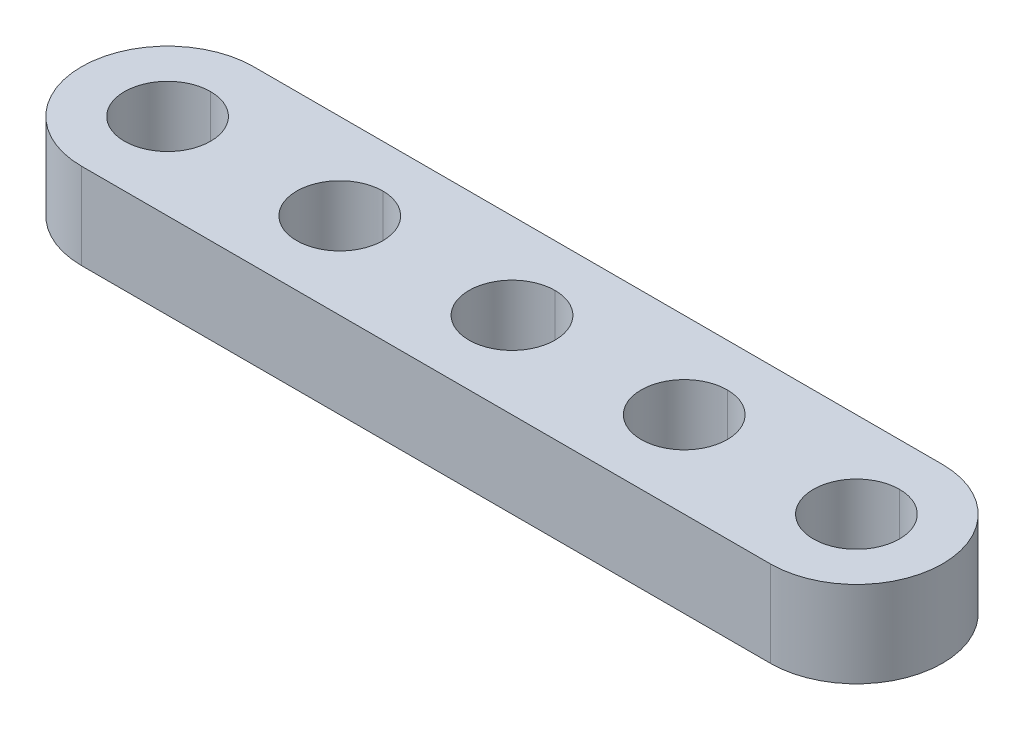
ISO-10303-21;
HEADER;
FILE_DESCRIPTION(('STEP AP214'),'2;1');
FILE_NAME('part.step','',(''),(''),'','','');
FILE_SCHEMA(('AUTOMOTIVE_DESIGN { 1 0 10303 214 1 1 1 1 }'));
ENDSEC;
DATA;
#1=APPLICATION_CONTEXT('core data for automotive mechanical design processes');
#2=APPLICATION_PROTOCOL_DEFINITION('international standard','automotive_design',2000,#1);
#3=PRODUCT_CONTEXT('',#1,'mechanical');
#4=PRODUCT('Part','Part','',(#3));
#5=PRODUCT_RELATED_PRODUCT_CATEGORY('part','',(#4));
#6=PRODUCT_DEFINITION_FORMATION('','',#4);
#7=PRODUCT_DEFINITION_CONTEXT('part definition',#1,'design');
#8=PRODUCT_DEFINITION('design','',#6,#7);
#9=PRODUCT_DEFINITION_SHAPE('','',#8);
#10=(LENGTH_UNIT() NAMED_UNIT(*) SI_UNIT(.MILLI.,.METRE.));
#11=(NAMED_UNIT(*) PLANE_ANGLE_UNIT() SI_UNIT($,.RADIAN.));
#12=(NAMED_UNIT(*) SI_UNIT($,.STERADIAN.) SOLID_ANGLE_UNIT());
#13=UNCERTAINTY_MEASURE_WITH_UNIT(LENGTH_MEASURE(1.E-05),#10,'distance_accuracy_value','');
#14=(GEOMETRIC_REPRESENTATION_CONTEXT(3) GLOBAL_UNCERTAINTY_ASSIGNED_CONTEXT((#13)) GLOBAL_UNIT_ASSIGNED_CONTEXT((#10,
#11,#12)) REPRESENTATION_CONTEXT('',''));
#15=CARTESIAN_POINT('',(0.,0.,0.));
#16=DIRECTION('',(0.,0.,1.));
#17=DIRECTION('',(1.,0.,0.));
#18=AXIS2_PLACEMENT_3D('',#15,#16,#17);
#19=CARTESIAN_POINT('',(16.,4.,0.));
#20=DIRECTION('',(0.,1.,0.));
#21=DIRECTION('',(0.,0.,1.));
#22=AXIS2_PLACEMENT_3D('',#19,#20,#21);
#23=CYLINDRICAL_SURFACE('',#22,2.);
#24=DIRECTION('',(0.,1.,0.));
#25=VECTOR('',#24,1.);
#26=CARTESIAN_POINT('',(16.,4.,-2.));
#27=LINE('',#26,#25);
#28=CARTESIAN_POINT('',(16.,0.,-2.));
#29=VERTEX_POINT('',#28);
#30=CARTESIAN_POINT('',(16.,4.,-2.));
#31=VERTEX_POINT('',#30);
#32=EDGE_CURVE('E163',#29,#31,#27,.T.);
#33=ORIENTED_EDGE('',*,*,#32,.F.);
#34=CARTESIAN_POINT('',(16.,0.,0.));
#35=DIRECTION('',(0.,1.,0.));
#36=DIRECTION('',(0.,0.,1.));
#37=AXIS2_PLACEMENT_3D('',#34,#35,#36);
#38=CIRCLE('',#37,2.);
#39=CARTESIAN_POINT('',(16.,0.,2.));
#40=VERTEX_POINT('',#39);
#41=EDGE_CURVE('E158',#40,#29,#38,.T.);
#42=ORIENTED_EDGE('',*,*,#41,.F.);
#43=DIRECTION('',(0.,1.,0.));
#44=VECTOR('',#43,1.);
#45=CARTESIAN_POINT('',(16.,4.,2.));
#46=LINE('',#45,#44);
#47=CARTESIAN_POINT('',(16.,4.,2.));
#48=VERTEX_POINT('',#47);
#49=EDGE_CURVE('E160',#40,#48,#46,.T.);
#50=ORIENTED_EDGE('',*,*,#49,.T.);
#51=CARTESIAN_POINT('',(16.,4.,0.));
#52=DIRECTION('',(0.,1.,0.));
#53=DIRECTION('',(0.,0.,1.));
#54=AXIS2_PLACEMENT_3D('',#51,#52,#53);
#55=CIRCLE('',#54,2.);
#56=EDGE_CURVE('E228',#48,#31,#55,.T.);
#57=ORIENTED_EDGE('',*,*,#56,.T.);
#58=EDGE_LOOP('',(#33,#42,#50,#57));
#59=FACE_BOUND('',#58,.T.);
#60=ADVANCED_FACE('F16',(#59),#23,.F.);
#61=CARTESIAN_POINT('',(8.,4.,0.));
#62=DIRECTION('',(0.,1.,0.));
#63=DIRECTION('',(0.,0.,1.));
#64=AXIS2_PLACEMENT_3D('',#61,#62,#63);
#65=CYLINDRICAL_SURFACE('',#64,2.);
#66=DIRECTION('',(0.,1.,0.));
#67=VECTOR('',#66,1.);
#68=CARTESIAN_POINT('',(8.,4.,-2.));
#69=LINE('',#68,#67);
#70=CARTESIAN_POINT('',(8.,0.,-2.));
#71=VERTEX_POINT('',#70);
#72=CARTESIAN_POINT('',(8.,4.,-2.));
#73=VERTEX_POINT('',#72);
#74=EDGE_CURVE('E208',#71,#73,#69,.T.);
#75=ORIENTED_EDGE('',*,*,#74,.F.);
#76=CARTESIAN_POINT('',(8.,0.,0.));
#77=DIRECTION('',(0.,1.,0.));
#78=DIRECTION('',(0.,0.,1.));
#79=AXIS2_PLACEMENT_3D('',#76,#77,#78);
#80=CIRCLE('',#79,2.);
#81=CARTESIAN_POINT('',(8.,0.,2.));
#82=VERTEX_POINT('',#81);
#83=EDGE_CURVE('E168',#82,#71,#80,.T.);
#84=ORIENTED_EDGE('',*,*,#83,.F.);
#85=DIRECTION('',(0.,1.,0.));
#86=VECTOR('',#85,1.);
#87=CARTESIAN_POINT('',(8.,4.,2.));
#88=LINE('',#87,#86);
#89=CARTESIAN_POINT('',(8.,4.,2.));
#90=VERTEX_POINT('',#89);
#91=EDGE_CURVE('E247',#82,#90,#88,.T.);
#92=ORIENTED_EDGE('',*,*,#91,.T.);
#93=CARTESIAN_POINT('',(8.,4.,0.));
#94=DIRECTION('',(0.,1.,0.));
#95=DIRECTION('',(0.,0.,1.));
#96=AXIS2_PLACEMENT_3D('',#93,#94,#95);
#97=CIRCLE('',#96,2.);
#98=EDGE_CURVE('E231',#90,#73,#97,.T.);
#99=ORIENTED_EDGE('',*,*,#98,.T.);
#100=EDGE_LOOP('',(#75,#84,#92,#99));
#101=FACE_BOUND('',#100,.T.);
#102=ADVANCED_FACE('F294',(#101),#65,.F.);
#103=CARTESIAN_POINT('',(0.,4.,0.));
#104=DIRECTION('',(0.,1.,0.));
#105=DIRECTION('',(0.,0.,1.));
#106=AXIS2_PLACEMENT_3D('',#103,#104,#105);
#107=CYLINDRICAL_SURFACE('',#106,2.);
#108=DIRECTION('',(0.,1.,0.));
#109=VECTOR('',#108,1.);
#110=CARTESIAN_POINT('',(0.,4.,-2.));
#111=LINE('',#110,#109);
#112=CARTESIAN_POINT('',(0.,0.,-2.));
#113=VERTEX_POINT('',#112);
#114=CARTESIAN_POINT('',(0.,4.,-2.));
#115=VERTEX_POINT('',#114);
#116=EDGE_CURVE('E274',#113,#115,#111,.T.);
#117=ORIENTED_EDGE('',*,*,#116,.F.);
#118=CARTESIAN_POINT('',(0.,0.,0.));
#119=DIRECTION('',(0.,1.,0.));
#120=DIRECTION('',(0.,0.,1.));
#121=AXIS2_PLACEMENT_3D('',#118,#119,#120);
#122=CIRCLE('',#121,2.);
#123=CARTESIAN_POINT('',(0.,0.,2.));
#124=VERTEX_POINT('',#123);
#125=EDGE_CURVE('E20',#124,#113,#122,.T.);
#126=ORIENTED_EDGE('',*,*,#125,.F.);
#127=DIRECTION('',(0.,1.,0.));
#128=VECTOR('',#127,1.);
#129=CARTESIAN_POINT('',(0.,4.,2.));
#130=LINE('',#129,#128);
#131=CARTESIAN_POINT('',(0.,4.,2.));
#132=VERTEX_POINT('',#131);
#133=EDGE_CURVE('E216',#124,#132,#130,.T.);
#134=ORIENTED_EDGE('',*,*,#133,.T.);
#135=CARTESIAN_POINT('',(0.,4.,0.));
#136=DIRECTION('',(0.,1.,0.));
#137=DIRECTION('',(0.,0.,1.));
#138=AXIS2_PLACEMENT_3D('',#135,#136,#137);
#139=CIRCLE('',#138,2.);
#140=EDGE_CURVE('E232',#132,#115,#139,.T.);
#141=ORIENTED_EDGE('',*,*,#140,.T.);
#142=EDGE_LOOP('',(#117,#126,#134,#141));
#143=FACE_BOUND('',#142,.T.);
#144=ADVANCED_FACE('F341',(#143),#107,.F.);
#145=CARTESIAN_POINT('',(-8.,4.,0.));
#146=DIRECTION('',(0.,1.,0.));
#147=DIRECTION('',(0.,0.,1.));
#148=AXIS2_PLACEMENT_3D('',#145,#146,#147);
#149=CYLINDRICAL_SURFACE('',#148,2.);
#150=DIRECTION('',(0.,1.,0.));
#151=VECTOR('',#150,1.);
#152=CARTESIAN_POINT('',(-8.,4.,-2.));
#153=LINE('',#152,#151);
#154=CARTESIAN_POINT('',(-8.,0.,-2.));
#155=VERTEX_POINT('',#154);
#156=CARTESIAN_POINT('',(-8.,4.,-2.));
#157=VERTEX_POINT('',#156);
#158=EDGE_CURVE('E202',#155,#157,#153,.T.);
#159=ORIENTED_EDGE('',*,*,#158,.F.);
#160=CARTESIAN_POINT('',(-8.,0.,0.));
#161=DIRECTION('',(0.,1.,0.));
#162=DIRECTION('',(0.,0.,1.));
#163=AXIS2_PLACEMENT_3D('',#160,#161,#162);
#164=CIRCLE('',#163,2.);
#165=CARTESIAN_POINT('',(-8.,0.,2.));
#166=VERTEX_POINT('',#165);
#167=EDGE_CURVE('E27',#166,#155,#164,.T.);
#168=ORIENTED_EDGE('',*,*,#167,.F.);
#169=DIRECTION('',(0.,1.,0.));
#170=VECTOR('',#169,1.);
#171=CARTESIAN_POINT('',(-8.,4.,2.));
#172=LINE('',#171,#170);
#173=CARTESIAN_POINT('',(-8.,4.,2.));
#174=VERTEX_POINT('',#173);
#175=EDGE_CURVE('E201',#166,#174,#172,.T.);
#176=ORIENTED_EDGE('',*,*,#175,.T.);
#177=CARTESIAN_POINT('',(-8.,4.,0.));
#178=DIRECTION('',(0.,1.,0.));
#179=DIRECTION('',(0.,0.,1.));
#180=AXIS2_PLACEMENT_3D('',#177,#178,#179);
#181=CIRCLE('',#180,2.);
#182=EDGE_CURVE('E236',#174,#157,#181,.T.);
#183=ORIENTED_EDGE('',*,*,#182,.T.);
#184=EDGE_LOOP('',(#159,#168,#176,#183));
#185=FACE_BOUND('',#184,.T.);
#186=ADVANCED_FACE('F493',(#185),#149,.F.);
#187=CARTESIAN_POINT('',(-16.,4.,0.));
#188=DIRECTION('',(0.,1.,0.));
#189=DIRECTION('',(0.,0.,1.));
#190=AXIS2_PLACEMENT_3D('',#187,#188,#189);
#191=CYLINDRICAL_SURFACE('',#190,2.);
#192=DIRECTION('',(0.,1.,0.));
#193=VECTOR('',#192,1.);
#194=CARTESIAN_POINT('',(-16.,4.,-2.));
#195=LINE('',#194,#193);
#196=CARTESIAN_POINT('',(-16.,0.,-2.));
#197=VERTEX_POINT('',#196);
#198=CARTESIAN_POINT('',(-16.,4.,-2.));
#199=VERTEX_POINT('',#198);
#200=EDGE_CURVE('E258',#197,#199,#195,.T.);
#201=ORIENTED_EDGE('',*,*,#200,.F.);
#202=CARTESIAN_POINT('',(-16.,0.,0.));
#203=DIRECTION('',(0.,1.,0.));
#204=DIRECTION('',(0.,0.,1.));
#205=AXIS2_PLACEMENT_3D('',#202,#203,#204);
#206=CIRCLE('',#205,2.);
#207=CARTESIAN_POINT('',(-16.,0.,2.));
#208=VERTEX_POINT('',#207);
#209=EDGE_CURVE('E11',#208,#197,#206,.T.);
#210=ORIENTED_EDGE('',*,*,#209,.F.);
#211=DIRECTION('',(0.,1.,0.));
#212=VECTOR('',#211,1.);
#213=CARTESIAN_POINT('',(-16.,4.,2.));
#214=LINE('',#213,#212);
#215=CARTESIAN_POINT('',(-16.,4.,2.));
#216=VERTEX_POINT('',#215);
#217=EDGE_CURVE('E257',#208,#216,#214,.T.);
#218=ORIENTED_EDGE('',*,*,#217,.T.);
#219=CARTESIAN_POINT('',(-16.,4.,0.));
#220=DIRECTION('',(0.,1.,0.));
#221=DIRECTION('',(0.,0.,1.));
#222=AXIS2_PLACEMENT_3D('',#219,#220,#221);
#223=CIRCLE('',#222,2.);
#224=EDGE_CURVE('E143',#216,#199,#223,.T.);
#225=ORIENTED_EDGE('',*,*,#224,.T.);
#226=EDGE_LOOP('',(#201,#210,#218,#225));
#227=FACE_BOUND('',#226,.T.);
#228=ADVANCED_FACE('F491',(#227),#191,.F.);
#229=CARTESIAN_POINT('',(-16.,0.,0.));
#230=DIRECTION('',(0.,1.,0.));
#231=DIRECTION('',(1.,0.,0.));
#232=AXIS2_PLACEMENT_3D('',#229,#230,#231);
#233=PLANE('',#232);
#234=ORIENTED_EDGE('',*,*,#209,.T.);
#235=CARTESIAN_POINT('',(-16.,0.,0.));
#236=DIRECTION('',(0.,1.,0.));
#237=DIRECTION('',(0.,0.,1.));
#238=AXIS2_PLACEMENT_3D('',#235,#236,#237);
#239=CIRCLE('',#238,2.);
#240=EDGE_CURVE('E262',#197,#208,#239,.T.);
#241=ORIENTED_EDGE('',*,*,#240,.T.);
#242=EDGE_LOOP('',(#234,#241));
#243=FACE_BOUND('',#242,.T.);
#244=ORIENTED_EDGE('',*,*,#167,.T.);
#245=CARTESIAN_POINT('',(-8.,0.,0.));
#246=DIRECTION('',(0.,1.,0.));
#247=DIRECTION('',(0.,0.,1.));
#248=AXIS2_PLACEMENT_3D('',#245,#246,#247);
#249=CIRCLE('',#248,2.);
#250=EDGE_CURVE('E207',#155,#166,#249,.T.);
#251=ORIENTED_EDGE('',*,*,#250,.T.);
#252=EDGE_LOOP('',(#244,#251));
#253=FACE_BOUND('',#252,.T.);
#254=ORIENTED_EDGE('',*,*,#125,.T.);
#255=CARTESIAN_POINT('',(0.,0.,0.));
#256=DIRECTION('',(0.,1.,0.));
#257=DIRECTION('',(0.,0.,1.));
#258=AXIS2_PLACEMENT_3D('',#255,#256,#257);
#259=CIRCLE('',#258,2.);
#260=EDGE_CURVE('E270',#113,#124,#259,.T.);
#261=ORIENTED_EDGE('',*,*,#260,.T.);
#262=EDGE_LOOP('',(#254,#261));
#263=FACE_BOUND('',#262,.T.);
#264=ORIENTED_EDGE('',*,*,#83,.T.);
#265=CARTESIAN_POINT('',(8.,0.,0.));
#266=DIRECTION('',(0.,1.,0.));
#267=DIRECTION('',(0.,0.,1.));
#268=AXIS2_PLACEMENT_3D('',#265,#266,#267);
#269=CIRCLE('',#268,2.);
#270=EDGE_CURVE('E176',#71,#82,#269,.T.);
#271=ORIENTED_EDGE('',*,*,#270,.T.);
#272=EDGE_LOOP('',(#264,#271));
#273=FACE_BOUND('',#272,.T.);
#274=ORIENTED_EDGE('',*,*,#41,.T.);
#275=CARTESIAN_POINT('',(16.,0.,0.));
#276=DIRECTION('',(0.,1.,0.));
#277=DIRECTION('',(0.,0.,1.));
#278=AXIS2_PLACEMENT_3D('',#275,#276,#277);
#279=CIRCLE('',#278,2.);
#280=EDGE_CURVE('E172',#29,#40,#279,.T.);
#281=ORIENTED_EDGE('',*,*,#280,.T.);
#282=EDGE_LOOP('',(#274,#281));
#283=FACE_BOUND('',#282,.T.);
#284=CARTESIAN_POINT('',(-16.,0.,0.));
#285=DIRECTION('',(0.,1.,0.));
#286=DIRECTION('',(0.,0.,1.));
#287=AXIS2_PLACEMENT_3D('',#284,#285,#286);
#288=CIRCLE('',#287,4.);
#289=CARTESIAN_POINT('',(-16.,0.,-4.));
#290=VERTEX_POINT('',#289);
#291=CARTESIAN_POINT('',(-16.,0.,4.));
#292=VERTEX_POINT('',#291);
#293=EDGE_CURVE('E252',#290,#292,#288,.T.);
#294=ORIENTED_EDGE('',*,*,#293,.F.);
#295=DIRECTION('',(-1.,0.,0.));
#296=VECTOR('',#295,1.);
#297=CARTESIAN_POINT('',(-16.,0.,-4.));
#298=LINE('',#297,#296);
#299=CARTESIAN_POINT('',(16.,0.,-4.));
#300=VERTEX_POINT('',#299);
#301=EDGE_CURVE('E194',#300,#290,#298,.T.);
#302=ORIENTED_EDGE('',*,*,#301,.F.);
#303=CARTESIAN_POINT('',(16.,0.,0.));
#304=DIRECTION('',(0.,1.,0.));
#305=DIRECTION('',(0.,0.,1.));
#306=AXIS2_PLACEMENT_3D('',#303,#304,#305);
#307=CIRCLE('',#306,4.);
#308=CARTESIAN_POINT('',(16.,0.,4.));
#309=VERTEX_POINT('',#308);
#310=EDGE_CURVE('E222',#309,#300,#307,.T.);
#311=ORIENTED_EDGE('',*,*,#310,.F.);
#312=DIRECTION('',(1.,0.,0.));
#313=VECTOR('',#312,1.);
#314=CARTESIAN_POINT('',(-16.,0.,4.));
#315=LINE('',#314,#313);
#316=EDGE_CURVE('E239',#292,#309,#315,.T.);
#317=ORIENTED_EDGE('',*,*,#316,.F.);
#318=EDGE_LOOP('',(#294,#302,#311,#317));
#319=FACE_BOUND('',#318,.T.);
#320=ADVANCED_FACE('F178',(#243,#253,#263,#273,#283,#319),#233,.F.);
#321=CARTESIAN_POINT('',(-16.,4.,0.));
#322=DIRECTION('',(0.,1.,0.));
#323=DIRECTION('',(1.,0.,0.));
#324=AXIS2_PLACEMENT_3D('',#321,#322,#323);
#325=PLANE('',#324);
#326=ORIENTED_EDGE('',*,*,#224,.F.);
#327=CARTESIAN_POINT('',(-16.,4.,0.));
#328=DIRECTION('',(0.,1.,0.));
#329=DIRECTION('',(0.,0.,1.));
#330=AXIS2_PLACEMENT_3D('',#327,#328,#329);
#331=CIRCLE('',#330,2.);
#332=EDGE_CURVE('E188',#199,#216,#331,.T.);
#333=ORIENTED_EDGE('',*,*,#332,.F.);
#334=EDGE_LOOP('',(#326,#333));
#335=FACE_BOUND('',#334,.T.);
#336=ORIENTED_EDGE('',*,*,#182,.F.);
#337=CARTESIAN_POINT('',(-8.,4.,0.));
#338=DIRECTION('',(0.,1.,0.));
#339=DIRECTION('',(0.,0.,1.));
#340=AXIS2_PLACEMENT_3D('',#337,#338,#339);
#341=CIRCLE('',#340,2.);
#342=EDGE_CURVE('E198',#157,#174,#341,.T.);
#343=ORIENTED_EDGE('',*,*,#342,.F.);
#344=EDGE_LOOP('',(#336,#343));
#345=FACE_BOUND('',#344,.T.);
#346=ORIENTED_EDGE('',*,*,#140,.F.);
#347=CARTESIAN_POINT('',(0.,4.,0.));
#348=DIRECTION('',(0.,1.,0.));
#349=DIRECTION('',(0.,0.,1.));
#350=AXIS2_PLACEMENT_3D('',#347,#348,#349);
#351=CIRCLE('',#350,2.);
#352=EDGE_CURVE('E283',#115,#132,#351,.T.);
#353=ORIENTED_EDGE('',*,*,#352,.F.);
#354=EDGE_LOOP('',(#346,#353));
#355=FACE_BOUND('',#354,.T.);
#356=ORIENTED_EDGE('',*,*,#98,.F.);
#357=CARTESIAN_POINT('',(8.,4.,0.));
#358=DIRECTION('',(0.,1.,0.));
#359=DIRECTION('',(0.,0.,1.));
#360=AXIS2_PLACEMENT_3D('',#357,#358,#359);
#361=CIRCLE('',#360,2.);
#362=EDGE_CURVE('E212',#73,#90,#361,.T.);
#363=ORIENTED_EDGE('',*,*,#362,.F.);
#364=EDGE_LOOP('',(#356,#363));
#365=FACE_BOUND('',#364,.T.);
#366=ORIENTED_EDGE('',*,*,#56,.F.);
#367=CARTESIAN_POINT('',(16.,4.,0.));
#368=DIRECTION('',(0.,1.,0.));
#369=DIRECTION('',(0.,0.,1.));
#370=AXIS2_PLACEMENT_3D('',#367,#368,#369);
#371=CIRCLE('',#370,2.);
#372=EDGE_CURVE('E174',#31,#48,#371,.T.);
#373=ORIENTED_EDGE('',*,*,#372,.F.);
#374=EDGE_LOOP('',(#366,#373));
#375=FACE_BOUND('',#374,.T.);
#376=CARTESIAN_POINT('',(-16.,4.,0.));
#377=DIRECTION('',(0.,1.,0.));
#378=DIRECTION('',(0.,0.,1.));
#379=AXIS2_PLACEMENT_3D('',#376,#377,#378);
#380=CIRCLE('',#379,4.);
#381=CARTESIAN_POINT('',(-16.,4.,-4.));
#382=VERTEX_POINT('',#381);
#383=CARTESIAN_POINT('',(-16.,4.,4.));
#384=VERTEX_POINT('',#383);
#385=EDGE_CURVE('E265',#382,#384,#380,.T.);
#386=ORIENTED_EDGE('',*,*,#385,.T.);
#387=DIRECTION('',(1.,0.,0.));
#388=VECTOR('',#387,1.);
#389=CARTESIAN_POINT('',(-16.,4.,4.));
#390=LINE('',#389,#388);
#391=CARTESIAN_POINT('',(16.,4.,4.));
#392=VERTEX_POINT('',#391);
#393=EDGE_CURVE('E223',#384,#392,#390,.T.);
#394=ORIENTED_EDGE('',*,*,#393,.T.);
#395=CARTESIAN_POINT('',(16.,4.,0.));
#396=DIRECTION('',(0.,1.,0.));
#397=DIRECTION('',(0.,0.,1.));
#398=AXIS2_PLACEMENT_3D('',#395,#396,#397);
#399=CIRCLE('',#398,4.);
#400=CARTESIAN_POINT('',(16.,4.,-4.));
#401=VERTEX_POINT('',#400);
#402=EDGE_CURVE('E191',#392,#401,#399,.T.);
#403=ORIENTED_EDGE('',*,*,#402,.T.);
#404=DIRECTION('',(-1.,0.,0.));
#405=VECTOR('',#404,1.);
#406=CARTESIAN_POINT('',(-16.,4.,-4.));
#407=LINE('',#406,#405);
#408=EDGE_CURVE('E42',#401,#382,#407,.T.);
#409=ORIENTED_EDGE('',*,*,#408,.T.);
#410=EDGE_LOOP('',(#386,#394,#403,#409));
#411=FACE_BOUND('',#410,.T.);
#412=ADVANCED_FACE('F300',(#335,#345,#355,#365,#375,#411),#325,.T.);
#413=CARTESIAN_POINT('',(-16.,4.,-4.));
#414=DIRECTION('',(0.,0.,1.));
#415=DIRECTION('',(1.,0.,0.));
#416=AXIS2_PLACEMENT_3D('',#413,#414,#415);
#417=PLANE('',#416);
#418=ORIENTED_EDGE('',*,*,#301,.T.);
#419=DIRECTION('',(0.,-1.,0.));
#420=VECTOR('',#419,1.);
#421=CARTESIAN_POINT('',(-16.,4.,-4.));
#422=LINE('',#421,#420);
#423=EDGE_CURVE('E243',#382,#290,#422,.T.);
#424=ORIENTED_EDGE('',*,*,#423,.F.);
#425=ORIENTED_EDGE('',*,*,#408,.F.);
#426=DIRECTION('',(0.,-1.,0.));
#427=VECTOR('',#426,1.);
#428=CARTESIAN_POINT('',(16.,4.,-4.));
#429=LINE('',#428,#427);
#430=EDGE_CURVE('E195',#401,#300,#429,.T.);
#431=ORIENTED_EDGE('',*,*,#430,.T.);
#432=EDGE_LOOP('',(#418,#424,#425,#431));
#433=FACE_BOUND('',#432,.T.);
#434=ADVANCED_FACE('F303',(#433),#417,.F.);
#435=CARTESIAN_POINT('',(16.,4.,0.));
#436=DIRECTION('',(0.,-1.,0.));
#437=DIRECTION('',(0.,0.,-1.));
#438=AXIS2_PLACEMENT_3D('',#435,#436,#437);
#439=CYLINDRICAL_SURFACE('',#438,4.);
#440=ORIENTED_EDGE('',*,*,#310,.T.);
#441=ORIENTED_EDGE('',*,*,#430,.F.);
#442=ORIENTED_EDGE('',*,*,#402,.F.);
#443=DIRECTION('',(0.,-1.,0.));
#444=VECTOR('',#443,1.);
#445=CARTESIAN_POINT('',(16.,4.,4.));
#446=LINE('',#445,#444);
#447=EDGE_CURVE('E227',#392,#309,#446,.T.);
#448=ORIENTED_EDGE('',*,*,#447,.T.);
#449=EDGE_LOOP('',(#440,#441,#442,#448));
#450=FACE_BOUND('',#449,.T.);
#451=ADVANCED_FACE('F456',(#450),#439,.T.);
#452=CARTESIAN_POINT('',(-16.,4.,4.));
#453=DIRECTION('',(0.,0.,-1.));
#454=DIRECTION('',(0.,-1.,0.));
#455=AXIS2_PLACEMENT_3D('',#452,#453,#454);
#456=PLANE('',#455);
#457=ORIENTED_EDGE('',*,*,#316,.T.);
#458=ORIENTED_EDGE('',*,*,#447,.F.);
#459=ORIENTED_EDGE('',*,*,#393,.F.);
#460=DIRECTION('',(0.,-1.,0.));
#461=VECTOR('',#460,1.);
#462=CARTESIAN_POINT('',(-16.,4.,4.));
#463=LINE('',#462,#461);
#464=EDGE_CURVE('E256',#384,#292,#463,.T.);
#465=ORIENTED_EDGE('',*,*,#464,.T.);
#466=EDGE_LOOP('',(#457,#458,#459,#465));
#467=FACE_BOUND('',#466,.T.);
#468=ADVANCED_FACE('F316',(#467),#456,.F.);
#469=CARTESIAN_POINT('',(-16.,4.,0.));
#470=DIRECTION('',(0.,-1.,0.));
#471=DIRECTION('',(0.,0.,-1.));
#472=AXIS2_PLACEMENT_3D('',#469,#470,#471);
#473=CYLINDRICAL_SURFACE('',#472,4.);
#474=ORIENTED_EDGE('',*,*,#293,.T.);
#475=ORIENTED_EDGE('',*,*,#464,.F.);
#476=ORIENTED_EDGE('',*,*,#385,.F.);
#477=ORIENTED_EDGE('',*,*,#423,.T.);
#478=EDGE_LOOP('',(#474,#475,#476,#477));
#479=FACE_BOUND('',#478,.T.);
#480=ADVANCED_FACE('F313',(#479),#473,.T.);
#481=CARTESIAN_POINT('',(-16.,4.,0.));
#482=DIRECTION('',(0.,1.,0.));
#483=DIRECTION('',(0.,0.,1.));
#484=AXIS2_PLACEMENT_3D('',#481,#482,#483);
#485=CYLINDRICAL_SURFACE('',#484,2.);
#486=ORIENTED_EDGE('',*,*,#240,.F.);
#487=ORIENTED_EDGE('',*,*,#200,.T.);
#488=ORIENTED_EDGE('',*,*,#332,.T.);
#489=ORIENTED_EDGE('',*,*,#217,.F.);
#490=EDGE_LOOP('',(#486,#487,#488,#489));
#491=FACE_BOUND('',#490,.T.);
#492=ADVANCED_FACE('F18',(#491),#485,.F.);
#493=CARTESIAN_POINT('',(-8.,4.,0.));
#494=DIRECTION('',(0.,1.,0.));
#495=DIRECTION('',(0.,0.,1.));
#496=AXIS2_PLACEMENT_3D('',#493,#494,#495);
#497=CYLINDRICAL_SURFACE('',#496,2.);
#498=ORIENTED_EDGE('',*,*,#250,.F.);
#499=ORIENTED_EDGE('',*,*,#158,.T.);
#500=ORIENTED_EDGE('',*,*,#342,.T.);
#501=ORIENTED_EDGE('',*,*,#175,.F.);
#502=EDGE_LOOP('',(#498,#499,#500,#501));
#503=FACE_BOUND('',#502,.T.);
#504=ADVANCED_FACE('F480',(#503),#497,.F.);
#505=CARTESIAN_POINT('',(0.,4.,0.));
#506=DIRECTION('',(0.,1.,0.));
#507=DIRECTION('',(0.,0.,1.));
#508=AXIS2_PLACEMENT_3D('',#505,#506,#507);
#509=CYLINDRICAL_SURFACE('',#508,2.);
#510=ORIENTED_EDGE('',*,*,#260,.F.);
#511=ORIENTED_EDGE('',*,*,#116,.T.);
#512=ORIENTED_EDGE('',*,*,#352,.T.);
#513=ORIENTED_EDGE('',*,*,#133,.F.);
#514=EDGE_LOOP('',(#510,#511,#512,#513));
#515=FACE_BOUND('',#514,.T.);
#516=ADVANCED_FACE('F345',(#515),#509,.F.);
#517=CARTESIAN_POINT('',(8.,4.,0.));
#518=DIRECTION('',(0.,1.,0.));
#519=DIRECTION('',(0.,0.,1.));
#520=AXIS2_PLACEMENT_3D('',#517,#518,#519);
#521=CYLINDRICAL_SURFACE('',#520,2.);
#522=ORIENTED_EDGE('',*,*,#270,.F.);
#523=ORIENTED_EDGE('',*,*,#74,.T.);
#524=ORIENTED_EDGE('',*,*,#362,.T.);
#525=ORIENTED_EDGE('',*,*,#91,.F.);
#526=EDGE_LOOP('',(#522,#523,#524,#525));
#527=FACE_BOUND('',#526,.T.);
#528=ADVANCED_FACE('F298',(#527),#521,.F.);
#529=CARTESIAN_POINT('',(16.,4.,0.));
#530=DIRECTION('',(0.,1.,0.));
#531=DIRECTION('',(0.,0.,1.));
#532=AXIS2_PLACEMENT_3D('',#529,#530,#531);
#533=CYLINDRICAL_SURFACE('',#532,2.);
#534=ORIENTED_EDGE('',*,*,#280,.F.);
#535=ORIENTED_EDGE('',*,*,#32,.T.);
#536=ORIENTED_EDGE('',*,*,#372,.T.);
#537=ORIENTED_EDGE('',*,*,#49,.F.);
#538=EDGE_LOOP('',(#534,#535,#536,#537));
#539=FACE_BOUND('',#538,.T.);
#540=ADVANCED_FACE('F171',(#539),#533,.F.);
#541=CLOSED_SHELL('',(#60,#102,#144,#186,#228,#320,#412,#434,#451,#468,#480,#492,#504,#516,#528,#540));
#542=MANIFOLD_SOLID_BREP('B1',#541);
#543=ADVANCED_BREP_SHAPE_REPRESENTATION('',(#18,#542),#14);
#544=SHAPE_DEFINITION_REPRESENTATION(#9,#543);
ENDSEC;
END-ISO-10303-21;
